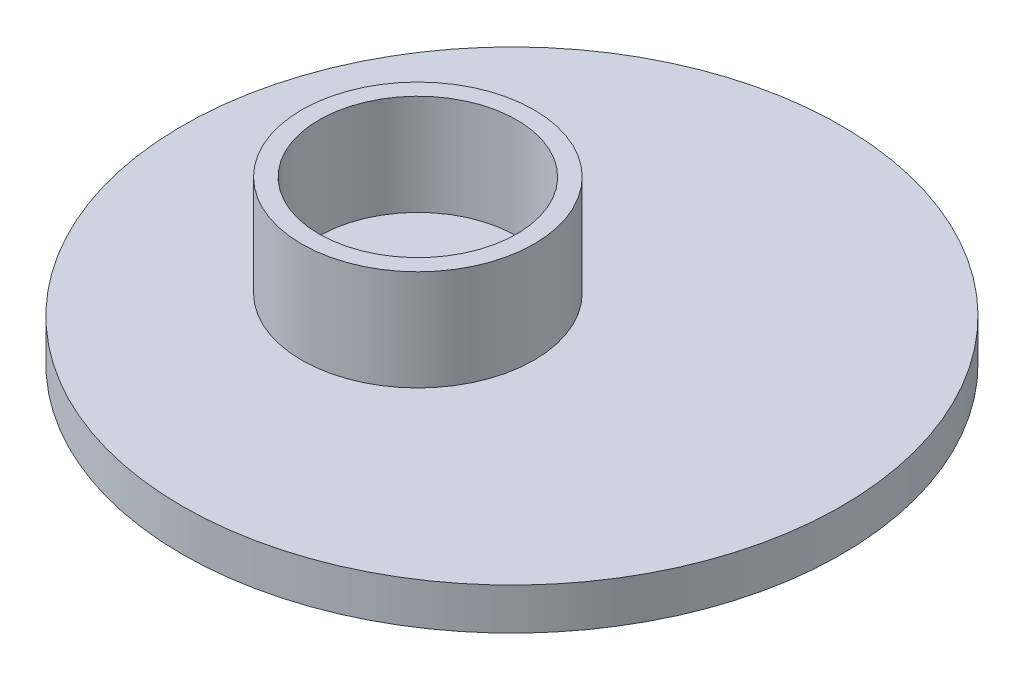
ISO-10303-21;
HEADER;
FILE_DESCRIPTION(('STEP AP214'),'2;1');
FILE_NAME('part.step','',(''),(''),'','','');
FILE_SCHEMA(('AUTOMOTIVE_DESIGN { 1 0 10303 214 1 1 1 1 }'));
ENDSEC;
DATA;
#1=APPLICATION_CONTEXT('core data for automotive mechanical design processes');
#2=APPLICATION_PROTOCOL_DEFINITION('international standard','automotive_design',2000,#1);
#3=PRODUCT_CONTEXT('',#1,'mechanical');
#4=PRODUCT('Part','Part','',(#3));
#5=PRODUCT_RELATED_PRODUCT_CATEGORY('part','',(#4));
#6=PRODUCT_DEFINITION_FORMATION('','',#4);
#7=PRODUCT_DEFINITION_CONTEXT('part definition',#1,'design');
#8=PRODUCT_DEFINITION('design','',#6,#7);
#9=PRODUCT_DEFINITION_SHAPE('','',#8);
#10=(LENGTH_UNIT() NAMED_UNIT(*) SI_UNIT(.MILLI.,.METRE.));
#11=(NAMED_UNIT(*) PLANE_ANGLE_UNIT() SI_UNIT($,.RADIAN.));
#12=(NAMED_UNIT(*) SI_UNIT($,.STERADIAN.) SOLID_ANGLE_UNIT());
#13=UNCERTAINTY_MEASURE_WITH_UNIT(LENGTH_MEASURE(1.E-05),#10,'distance_accuracy_value','');
#14=(GEOMETRIC_REPRESENTATION_CONTEXT(3) GLOBAL_UNCERTAINTY_ASSIGNED_CONTEXT((#13)) GLOBAL_UNIT_ASSIGNED_CONTEXT((#10,
#11,#12)) REPRESENTATION_CONTEXT('',''));
#15=CARTESIAN_POINT('',(0.,0.,0.));
#16=DIRECTION('',(0.,0.,1.));
#17=DIRECTION('',(1.,0.,0.));
#18=AXIS2_PLACEMENT_3D('',#15,#16,#17);
#19=CARTESIAN_POINT('',(0.,1.2,0.));
#20=DIRECTION('',(0.,1.,0.));
#21=DIRECTION('',(0.,0.,1.));
#22=AXIS2_PLACEMENT_3D('',#19,#20,#21);
#23=PLANE('',#22);
#24=CARTESIAN_POINT('',(0.,1.2,0.));
#25=DIRECTION('',(0.,1.,0.));
#26=DIRECTION('',(0.,0.,1.));
#27=AXIS2_PLACEMENT_3D('',#24,#25,#26);
#28=CIRCLE('',#27,9.5);
#29=CARTESIAN_POINT('',(0.,1.2,9.5));
#30=VERTEX_POINT('',#29);
#31=EDGE_CURVE('E38',#30,#30,#28,.T.);
#32=ORIENTED_EDGE('',*,*,#31,.T.);
#33=EDGE_LOOP('',(#32));
#34=FACE_BOUND('',#33,.T.);
#35=CARTESIAN_POINT('',(-1.92779547461441,1.2,0.783841227327997));
#36=DIRECTION('',(0.,1.,0.));
#37=DIRECTION('',(0.,0.,1.));
#38=AXIS2_PLACEMENT_3D('',#35,#36,#37);
#39=CIRCLE('',#38,3.35);
#40=CARTESIAN_POINT('',(-1.92779547461441,1.2,4.133841227328));
#41=VERTEX_POINT('',#40);
#42=EDGE_CURVE('E49',#41,#41,#39,.T.);
#43=ORIENTED_EDGE('',*,*,#42,.F.);
#44=EDGE_LOOP('',(#43));
#45=FACE_BOUND('',#44,.T.);
#46=ADVANCED_FACE('F31',(#34,#45),#23,.T.);
#47=CARTESIAN_POINT('',(0.,1.2,0.));
#48=DIRECTION('',(0.,-1.,0.));
#49=DIRECTION('',(0.,0.,-1.));
#50=AXIS2_PLACEMENT_3D('',#47,#48,#49);
#51=CYLINDRICAL_SURFACE('',#50,9.5);
#52=ORIENTED_EDGE('',*,*,#31,.F.);
#53=EDGE_LOOP('',(#52));
#54=FACE_BOUND('',#53,.T.);
#55=CARTESIAN_POINT('',(0.,0.,0.));
#56=DIRECTION('',(0.,1.,0.));
#57=DIRECTION('',(0.,0.,1.));
#58=AXIS2_PLACEMENT_3D('',#55,#56,#57);
#59=CIRCLE('',#58,9.5);
#60=CARTESIAN_POINT('',(0.,0.,9.5));
#61=VERTEX_POINT('',#60);
#62=EDGE_CURVE('E42',#61,#61,#59,.T.);
#63=ORIENTED_EDGE('',*,*,#62,.T.);
#64=EDGE_LOOP('',(#63));
#65=FACE_BOUND('',#64,.T.);
#66=ADVANCED_FACE('F33',(#54,#65),#51,.T.);
#67=CARTESIAN_POINT('',(0.,0.,0.));
#68=DIRECTION('',(0.,1.,0.));
#69=DIRECTION('',(0.,0.,1.));
#70=AXIS2_PLACEMENT_3D('',#67,#68,#69);
#71=PLANE('',#70);
#72=ORIENTED_EDGE('',*,*,#62,.F.);
#73=EDGE_LOOP('',(#72));
#74=FACE_BOUND('',#73,.T.);
#75=ADVANCED_FACE('F63',(#74),#71,.F.);
#76=CARTESIAN_POINT('',(-1.92779547461441,4.1,0.783841227327997));
#77=DIRECTION('',(0.,1.,0.));
#78=DIRECTION('',(0.,0.,1.));
#79=AXIS2_PLACEMENT_3D('',#76,#77,#78);
#80=PLANE('',#79);
#81=CARTESIAN_POINT('',(-1.92779547461441,4.1,0.783841227327997));
#82=DIRECTION('',(0.,1.,0.));
#83=DIRECTION('',(0.,0.,1.));
#84=AXIS2_PLACEMENT_3D('',#81,#82,#83);
#85=CIRCLE('',#84,3.35);
#86=CARTESIAN_POINT('',(-1.92779547461441,4.1,4.133841227328));
#87=VERTEX_POINT('',#86);
#88=EDGE_CURVE('E47',#87,#87,#85,.T.);
#89=ORIENTED_EDGE('',*,*,#88,.T.);
#90=EDGE_LOOP('',(#89));
#91=FACE_BOUND('',#90,.T.);
#92=CARTESIAN_POINT('',(-1.92779547461441,4.1,0.783841227327997));
#93=DIRECTION('',(0.,1.,0.));
#94=DIRECTION('',(0.,0.,1.));
#95=AXIS2_PLACEMENT_3D('',#92,#93,#94);
#96=CIRCLE('',#95,2.85);
#97=CARTESIAN_POINT('',(-1.92779547461441,4.1,3.633841227328));
#98=VERTEX_POINT('',#97);
#99=EDGE_CURVE('E52',#98,#98,#96,.T.);
#100=ORIENTED_EDGE('',*,*,#99,.F.);
#101=EDGE_LOOP('',(#100));
#102=FACE_BOUND('',#101,.T.);
#103=ADVANCED_FACE('F60',(#91,#102),#80,.T.);
#104=CARTESIAN_POINT('',(-1.92779547461441,4.1,0.783841227327997));
#105=DIRECTION('',(0.,-1.,0.));
#106=DIRECTION('',(0.,0.,-1.));
#107=AXIS2_PLACEMENT_3D('',#104,#105,#106);
#108=CYLINDRICAL_SURFACE('',#107,3.35);
#109=ORIENTED_EDGE('',*,*,#88,.F.);
#110=EDGE_LOOP('',(#109));
#111=FACE_BOUND('',#110,.T.);
#112=ORIENTED_EDGE('',*,*,#42,.T.);
#113=EDGE_LOOP('',(#112));
#114=FACE_BOUND('',#113,.T.);
#115=ADVANCED_FACE('F62',(#111,#114),#108,.T.);
#116=CARTESIAN_POINT('',(-1.92779547461441,4.1,0.783841227327997));
#117=DIRECTION('',(0.,-1.,0.));
#118=DIRECTION('',(0.,0.,-1.));
#119=AXIS2_PLACEMENT_3D('',#116,#117,#118);
#120=CYLINDRICAL_SURFACE('',#119,2.85);
#121=ORIENTED_EDGE('',*,*,#99,.T.);
#122=EDGE_LOOP('',(#121));
#123=FACE_BOUND('',#122,.T.);
#124=CARTESIAN_POINT('',(-1.92779547461441,1.2,0.783841227327997));
#125=DIRECTION('',(0.,1.,0.));
#126=DIRECTION('',(0.,0.,1.));
#127=AXIS2_PLACEMENT_3D('',#124,#125,#126);
#128=CIRCLE('',#127,2.85);
#129=CARTESIAN_POINT('',(-1.92779547461441,1.2,3.633841227328));
#130=VERTEX_POINT('',#129);
#131=EDGE_CURVE('E10',#130,#130,#128,.F.);
#132=ORIENTED_EDGE('',*,*,#131,.T.);
#133=EDGE_LOOP('',(#132));
#134=FACE_BOUND('',#133,.T.);
#135=ADVANCED_FACE('F58',(#123,#134),#120,.F.);
#136=ORIENTED_EDGE('',*,*,#131,.F.);
#137=EDGE_LOOP('',(#136));
#138=FACE_BOUND('',#137,.T.);
#139=ADVANCED_FACE('F76',(#138),#23,.T.);
#140=CLOSED_SHELL('',(#46,#66,#75,#103,#115,#135,#139));
#141=MANIFOLD_SOLID_BREP('B2',#140);
#142=ADVANCED_BREP_SHAPE_REPRESENTATION('',(#18,#141),#14);
#143=SHAPE_DEFINITION_REPRESENTATION(#9,#142);
ENDSEC;
END-ISO-10303-21;
